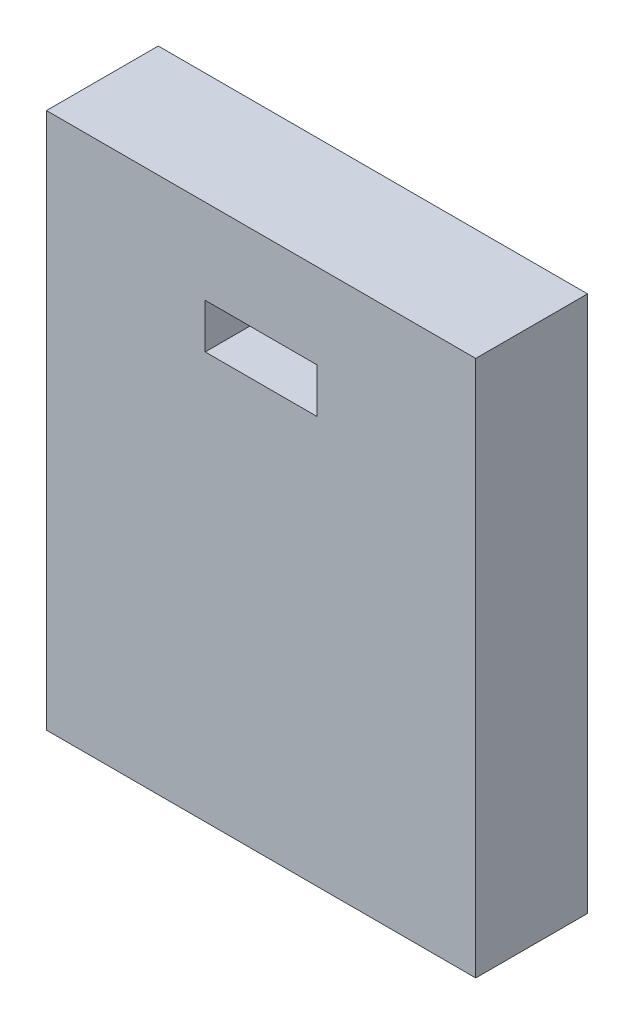
ISO-10303-21;
HEADER;
FILE_DESCRIPTION(('STEP AP214'),'2;1');
FILE_NAME('part.step','',(''),(''),'','','');
FILE_SCHEMA(('AUTOMOTIVE_DESIGN { 1 0 10303 214 1 1 1 1 }'));
ENDSEC;
DATA;
#1=APPLICATION_CONTEXT('core data for automotive mechanical design processes');
#2=APPLICATION_PROTOCOL_DEFINITION('international standard','automotive_design',2000,#1);
#3=PRODUCT_CONTEXT('',#1,'mechanical');
#4=PRODUCT('Part','Part','',(#3));
#5=PRODUCT_RELATED_PRODUCT_CATEGORY('part','',(#4));
#6=PRODUCT_DEFINITION_FORMATION('','',#4);
#7=PRODUCT_DEFINITION_CONTEXT('part definition',#1,'design');
#8=PRODUCT_DEFINITION('design','',#6,#7);
#9=PRODUCT_DEFINITION_SHAPE('','',#8);
#10=(LENGTH_UNIT() NAMED_UNIT(*) SI_UNIT(.MILLI.,.METRE.));
#11=(NAMED_UNIT(*) PLANE_ANGLE_UNIT() SI_UNIT($,.RADIAN.));
#12=(NAMED_UNIT(*) SI_UNIT($,.STERADIAN.) SOLID_ANGLE_UNIT());
#13=UNCERTAINTY_MEASURE_WITH_UNIT(LENGTH_MEASURE(1.E-05),#10,'distance_accuracy_value','');
#14=(GEOMETRIC_REPRESENTATION_CONTEXT(3) GLOBAL_UNCERTAINTY_ASSIGNED_CONTEXT((#13)) GLOBAL_UNIT_ASSIGNED_CONTEXT((#10,
#11,#12)) REPRESENTATION_CONTEXT('',''));
#15=CARTESIAN_POINT('',(0.,0.,0.));
#16=DIRECTION('',(0.,0.,1.));
#17=DIRECTION('',(1.,0.,0.));
#18=AXIS2_PLACEMENT_3D('',#15,#16,#17);
#19=CARTESIAN_POINT('',(0.,0.,3.175));
#20=DIRECTION('',(1.,0.,0.));
#21=DIRECTION('',(0.,0.,-1.));
#22=AXIS2_PLACEMENT_3D('',#19,#20,#21);
#23=PLANE('',#22);
#24=DIRECTION('',(0.,-1.,0.));
#25=VECTOR('',#24,1.);
#26=CARTESIAN_POINT('',(0.,0.,0.));
#27=LINE('',#26,#25);
#28=CARTESIAN_POINT('',(0.,15.24,0.));
#29=VERTEX_POINT('',#28);
#30=CARTESIAN_POINT('',(0.,0.,0.));
#31=VERTEX_POINT('',#30);
#32=EDGE_CURVE('E134',#29,#31,#27,.T.);
#33=ORIENTED_EDGE('',*,*,#32,.T.);
#34=DIRECTION('',(0.,0.,-1.));
#35=VECTOR('',#34,1.);
#36=CARTESIAN_POINT('',(0.,0.,3.175));
#37=LINE('',#36,#35);
#38=CARTESIAN_POINT('',(0.,0.,3.175));
#39=VERTEX_POINT('',#38);
#40=EDGE_CURVE('E11',#39,#31,#37,.T.);
#41=ORIENTED_EDGE('',*,*,#40,.F.);
#42=DIRECTION('',(0.,-1.,0.));
#43=VECTOR('',#42,1.);
#44=CARTESIAN_POINT('',(0.,0.,3.175));
#45=LINE('',#44,#43);
#46=CARTESIAN_POINT('',(0.,15.24,3.175));
#47=VERTEX_POINT('',#46);
#48=EDGE_CURVE('E138',#47,#39,#45,.T.);
#49=ORIENTED_EDGE('',*,*,#48,.F.);
#50=DIRECTION('',(0.,0.,-1.));
#51=VECTOR('',#50,1.);
#52=CARTESIAN_POINT('',(0.,15.24,3.175));
#53=LINE('',#52,#51);
#54=EDGE_CURVE('E148',#47,#29,#53,.T.);
#55=ORIENTED_EDGE('',*,*,#54,.T.);
#56=EDGE_LOOP('',(#33,#41,#49,#55));
#57=FACE_BOUND('',#56,.T.);
#58=ADVANCED_FACE('F37',(#57),#23,.F.);
#59=CARTESIAN_POINT('',(0.,0.,3.175));
#60=DIRECTION('',(0.,1.,0.));
#61=DIRECTION('',(0.,0.,1.));
#62=AXIS2_PLACEMENT_3D('',#59,#60,#61);
#63=PLANE('',#62);
#64=DIRECTION('',(1.,0.,0.));
#65=VECTOR('',#64,1.);
#66=CARTESIAN_POINT('',(0.,0.,0.));
#67=LINE('',#66,#65);
#68=CARTESIAN_POINT('',(12.192,0.,0.));
#69=VERTEX_POINT('',#68);
#70=EDGE_CURVE('E151',#31,#69,#67,.T.);
#71=ORIENTED_EDGE('',*,*,#70,.T.);
#72=DIRECTION('',(0.,0.,-1.));
#73=VECTOR('',#72,1.);
#74=CARTESIAN_POINT('',(12.192,0.,3.175));
#75=LINE('',#74,#73);
#76=CARTESIAN_POINT('',(12.192,0.,3.175));
#77=VERTEX_POINT('',#76);
#78=EDGE_CURVE('E44',#77,#69,#75,.T.);
#79=ORIENTED_EDGE('',*,*,#78,.F.);
#80=DIRECTION('',(1.,0.,0.));
#81=VECTOR('',#80,1.);
#82=CARTESIAN_POINT('',(0.,0.,3.175));
#83=LINE('',#82,#81);
#84=EDGE_CURVE('E141',#39,#77,#83,.T.);
#85=ORIENTED_EDGE('',*,*,#84,.F.);
#86=ORIENTED_EDGE('',*,*,#40,.T.);
#87=EDGE_LOOP('',(#71,#79,#85,#86));
#88=FACE_BOUND('',#87,.T.);
#89=ADVANCED_FACE('F179',(#88),#63,.F.);
#90=CARTESIAN_POINT('',(12.192,0.,3.175));
#91=DIRECTION('',(-1.,0.,0.));
#92=DIRECTION('',(0.,0.,1.));
#93=AXIS2_PLACEMENT_3D('',#90,#91,#92);
#94=PLANE('',#93);
#95=DIRECTION('',(0.,1.,0.));
#96=VECTOR('',#95,1.);
#97=CARTESIAN_POINT('',(12.192,0.,0.));
#98=LINE('',#97,#96);
#99=CARTESIAN_POINT('',(12.192,15.24,0.));
#100=VERTEX_POINT('',#99);
#101=EDGE_CURVE('E153',#69,#100,#98,.T.);
#102=ORIENTED_EDGE('',*,*,#101,.T.);
#103=DIRECTION('',(0.,0.,-1.));
#104=VECTOR('',#103,1.);
#105=CARTESIAN_POINT('',(12.192,15.24,3.175));
#106=LINE('',#105,#104);
#107=CARTESIAN_POINT('',(12.192,15.24,3.175));
#108=VERTEX_POINT('',#107);
#109=EDGE_CURVE('E158',#108,#100,#106,.T.);
#110=ORIENTED_EDGE('',*,*,#109,.F.);
#111=DIRECTION('',(0.,1.,0.));
#112=VECTOR('',#111,1.);
#113=CARTESIAN_POINT('',(12.192,0.,3.175));
#114=LINE('',#113,#112);
#115=EDGE_CURVE('E144',#77,#108,#114,.T.);
#116=ORIENTED_EDGE('',*,*,#115,.F.);
#117=ORIENTED_EDGE('',*,*,#78,.T.);
#118=EDGE_LOOP('',(#102,#110,#116,#117));
#119=FACE_BOUND('',#118,.T.);
#120=ADVANCED_FACE('F165',(#119),#94,.F.);
#121=CARTESIAN_POINT('',(0.,15.24,3.175));
#122=DIRECTION('',(0.,-1.,0.));
#123=DIRECTION('',(0.,0.,-1.));
#124=AXIS2_PLACEMENT_3D('',#121,#122,#123);
#125=PLANE('',#124);
#126=DIRECTION('',(-1.,0.,0.));
#127=VECTOR('',#126,1.);
#128=CARTESIAN_POINT('',(0.,15.24,0.));
#129=LINE('',#128,#127);
#130=EDGE_CURVE('E142',#100,#29,#129,.T.);
#131=ORIENTED_EDGE('',*,*,#130,.T.);
#132=ORIENTED_EDGE('',*,*,#54,.F.);
#133=DIRECTION('',(-1.,0.,0.));
#134=VECTOR('',#133,1.);
#135=CARTESIAN_POINT('',(0.,15.24,3.175));
#136=LINE('',#135,#134);
#137=EDGE_CURVE('E146',#108,#47,#136,.T.);
#138=ORIENTED_EDGE('',*,*,#137,.F.);
#139=ORIENTED_EDGE('',*,*,#109,.T.);
#140=EDGE_LOOP('',(#131,#132,#138,#139));
#141=FACE_BOUND('',#140,.T.);
#142=ADVANCED_FACE('F172',(#141),#125,.F.);
#143=CARTESIAN_POINT('',(0.,0.,3.175));
#144=DIRECTION('',(0.,0.,-1.));
#145=DIRECTION('',(-1.,0.,0.));
#146=AXIS2_PLACEMENT_3D('',#143,#144,#145);
#147=PLANE('',#146);
#148=DIRECTION('',(1.,0.,0.));
#149=VECTOR('',#148,1.);
#150=CARTESIAN_POINT('',(4.5085,11.557,3.175));
#151=LINE('',#150,#149);
#152=CARTESIAN_POINT('',(4.5085,11.557,3.175));
#153=VERTEX_POINT('',#152);
#154=CARTESIAN_POINT('',(7.6835,11.557,3.175));
#155=VERTEX_POINT('',#154);
#156=EDGE_CURVE('E128',#153,#155,#151,.T.);
#157=ORIENTED_EDGE('',*,*,#156,.F.);
#158=DIRECTION('',(0.,-1.,0.));
#159=VECTOR('',#158,1.);
#160=CARTESIAN_POINT('',(4.5085,11.557,3.175));
#161=LINE('',#160,#159);
#162=CARTESIAN_POINT('',(4.5085,12.827,3.175));
#163=VERTEX_POINT('',#162);
#164=EDGE_CURVE('E51',#163,#153,#161,.T.);
#165=ORIENTED_EDGE('',*,*,#164,.F.);
#166=DIRECTION('',(-1.,0.,0.));
#167=VECTOR('',#166,1.);
#168=CARTESIAN_POINT('',(4.5085,12.827,3.175));
#169=LINE('',#168,#167);
#170=CARTESIAN_POINT('',(7.6835,12.827,3.175));
#171=VERTEX_POINT('',#170);
#172=EDGE_CURVE('E119',#171,#163,#169,.T.);
#173=ORIENTED_EDGE('',*,*,#172,.F.);
#174=DIRECTION('',(0.,1.,0.));
#175=VECTOR('',#174,1.);
#176=CARTESIAN_POINT('',(7.6835,11.557,3.175));
#177=LINE('',#176,#175);
#178=EDGE_CURVE('E122',#155,#171,#177,.T.);
#179=ORIENTED_EDGE('',*,*,#178,.F.);
#180=EDGE_LOOP('',(#157,#165,#173,#179));
#181=FACE_BOUND('',#180,.T.);
#182=ORIENTED_EDGE('',*,*,#48,.T.);
#183=ORIENTED_EDGE('',*,*,#84,.T.);
#184=ORIENTED_EDGE('',*,*,#115,.T.);
#185=ORIENTED_EDGE('',*,*,#137,.T.);
#186=EDGE_LOOP('',(#182,#183,#184,#185));
#187=FACE_BOUND('',#186,.T.);
#188=ADVANCED_FACE('F178',(#181,#187),#147,.F.);
#189=CARTESIAN_POINT('',(0.,0.,0.));
#190=DIRECTION('',(0.,0.,-1.));
#191=DIRECTION('',(-1.,0.,0.));
#192=AXIS2_PLACEMENT_3D('',#189,#190,#191);
#193=PLANE('',#192);
#194=DIRECTION('',(0.,-1.,0.));
#195=VECTOR('',#194,1.);
#196=CARTESIAN_POINT('',(4.5085,11.557,0.));
#197=LINE('',#196,#195);
#198=CARTESIAN_POINT('',(4.5085,12.827,0.));
#199=VERTEX_POINT('',#198);
#200=CARTESIAN_POINT('',(4.5085,11.557,0.));
#201=VERTEX_POINT('',#200);
#202=EDGE_CURVE('E103',#199,#201,#197,.T.);
#203=ORIENTED_EDGE('',*,*,#202,.T.);
#204=DIRECTION('',(1.,0.,0.));
#205=VECTOR('',#204,1.);
#206=CARTESIAN_POINT('',(4.5085,11.557,0.));
#207=LINE('',#206,#205);
#208=CARTESIAN_POINT('',(7.6835,11.557,0.));
#209=VERTEX_POINT('',#208);
#210=EDGE_CURVE('E112',#201,#209,#207,.T.);
#211=ORIENTED_EDGE('',*,*,#210,.T.);
#212=DIRECTION('',(0.,1.,0.));
#213=VECTOR('',#212,1.);
#214=CARTESIAN_POINT('',(7.6835,11.557,0.));
#215=LINE('',#214,#213);
#216=CARTESIAN_POINT('',(7.6835,12.827,0.));
#217=VERTEX_POINT('',#216);
#218=EDGE_CURVE('E59',#209,#217,#215,.T.);
#219=ORIENTED_EDGE('',*,*,#218,.T.);
#220=DIRECTION('',(-1.,0.,0.));
#221=VECTOR('',#220,1.);
#222=CARTESIAN_POINT('',(4.5085,12.827,0.));
#223=LINE('',#222,#221);
#224=EDGE_CURVE('E109',#217,#199,#223,.T.);
#225=ORIENTED_EDGE('',*,*,#224,.T.);
#226=EDGE_LOOP('',(#203,#211,#219,#225));
#227=FACE_BOUND('',#226,.T.);
#228=ORIENTED_EDGE('',*,*,#32,.F.);
#229=ORIENTED_EDGE('',*,*,#130,.F.);
#230=ORIENTED_EDGE('',*,*,#101,.F.);
#231=ORIENTED_EDGE('',*,*,#70,.F.);
#232=EDGE_LOOP('',(#228,#229,#230,#231));
#233=FACE_BOUND('',#232,.T.);
#234=ADVANCED_FACE('F116',(#227,#233),#193,.T.);
#235=CARTESIAN_POINT('',(4.5085,11.557,0.));
#236=DIRECTION('',(-1.,0.,0.));
#237=DIRECTION('',(0.,0.,1.));
#238=AXIS2_PLACEMENT_3D('',#235,#236,#237);
#239=PLANE('',#238);
#240=ORIENTED_EDGE('',*,*,#164,.T.);
#241=DIRECTION('',(0.,0.,1.));
#242=VECTOR('',#241,1.);
#243=CARTESIAN_POINT('',(4.5085,11.557,0.));
#244=LINE('',#243,#242);
#245=EDGE_CURVE('E99',#201,#153,#244,.T.);
#246=ORIENTED_EDGE('',*,*,#245,.F.);
#247=ORIENTED_EDGE('',*,*,#202,.F.);
#248=DIRECTION('',(0.,0.,1.));
#249=VECTOR('',#248,1.);
#250=CARTESIAN_POINT('',(4.5085,12.827,0.));
#251=LINE('',#250,#249);
#252=EDGE_CURVE('E132',#199,#163,#251,.T.);
#253=ORIENTED_EDGE('',*,*,#252,.T.);
#254=EDGE_LOOP('',(#240,#246,#247,#253));
#255=FACE_BOUND('',#254,.T.);
#256=ADVANCED_FACE('F101',(#255),#239,.F.);
#257=CARTESIAN_POINT('',(4.5085,12.827,0.));
#258=DIRECTION('',(0.,1.,0.));
#259=DIRECTION('',(0.,0.,1.));
#260=AXIS2_PLACEMENT_3D('',#257,#258,#259);
#261=PLANE('',#260);
#262=ORIENTED_EDGE('',*,*,#172,.T.);
#263=ORIENTED_EDGE('',*,*,#252,.F.);
#264=ORIENTED_EDGE('',*,*,#224,.F.);
#265=DIRECTION('',(0.,0.,1.));
#266=VECTOR('',#265,1.);
#267=CARTESIAN_POINT('',(7.6835,12.827,0.));
#268=LINE('',#267,#266);
#269=EDGE_CURVE('E135',#217,#171,#268,.T.);
#270=ORIENTED_EDGE('',*,*,#269,.T.);
#271=EDGE_LOOP('',(#262,#263,#264,#270));
#272=FACE_BOUND('',#271,.T.);
#273=ADVANCED_FACE('F196',(#272),#261,.F.);
#274=CARTESIAN_POINT('',(7.6835,11.557,0.));
#275=DIRECTION('',(1.,0.,0.));
#276=DIRECTION('',(0.,0.,-1.));
#277=AXIS2_PLACEMENT_3D('',#274,#275,#276);
#278=PLANE('',#277);
#279=ORIENTED_EDGE('',*,*,#178,.T.);
#280=ORIENTED_EDGE('',*,*,#269,.F.);
#281=ORIENTED_EDGE('',*,*,#218,.F.);
#282=DIRECTION('',(0.,0.,1.));
#283=VECTOR('',#282,1.);
#284=CARTESIAN_POINT('',(7.6835,11.557,0.));
#285=LINE('',#284,#283);
#286=EDGE_CURVE('E108',#209,#155,#285,.T.);
#287=ORIENTED_EDGE('',*,*,#286,.T.);
#288=EDGE_LOOP('',(#279,#280,#281,#287));
#289=FACE_BOUND('',#288,.T.);
#290=ADVANCED_FACE('F199',(#289),#278,.F.);
#291=CARTESIAN_POINT('',(4.5085,11.557,0.));
#292=DIRECTION('',(0.,-1.,0.));
#293=DIRECTION('',(0.,0.,-1.));
#294=AXIS2_PLACEMENT_3D('',#291,#292,#293);
#295=PLANE('',#294);
#296=ORIENTED_EDGE('',*,*,#156,.T.);
#297=ORIENTED_EDGE('',*,*,#286,.F.);
#298=ORIENTED_EDGE('',*,*,#210,.F.);
#299=ORIENTED_EDGE('',*,*,#245,.T.);
#300=EDGE_LOOP('',(#296,#297,#298,#299));
#301=FACE_BOUND('',#300,.T.);
#302=ADVANCED_FACE('F113',(#301),#295,.F.);
#303=CLOSED_SHELL('',(#58,#89,#120,#142,#188,#234,#256,#273,#290,#302));
#304=MANIFOLD_SOLID_BREP('B2',#303);
#305=ADVANCED_BREP_SHAPE_REPRESENTATION('',(#18,#304),#14);
#306=SHAPE_DEFINITION_REPRESENTATION(#9,#305);
ENDSEC;
END-ISO-10303-21;
